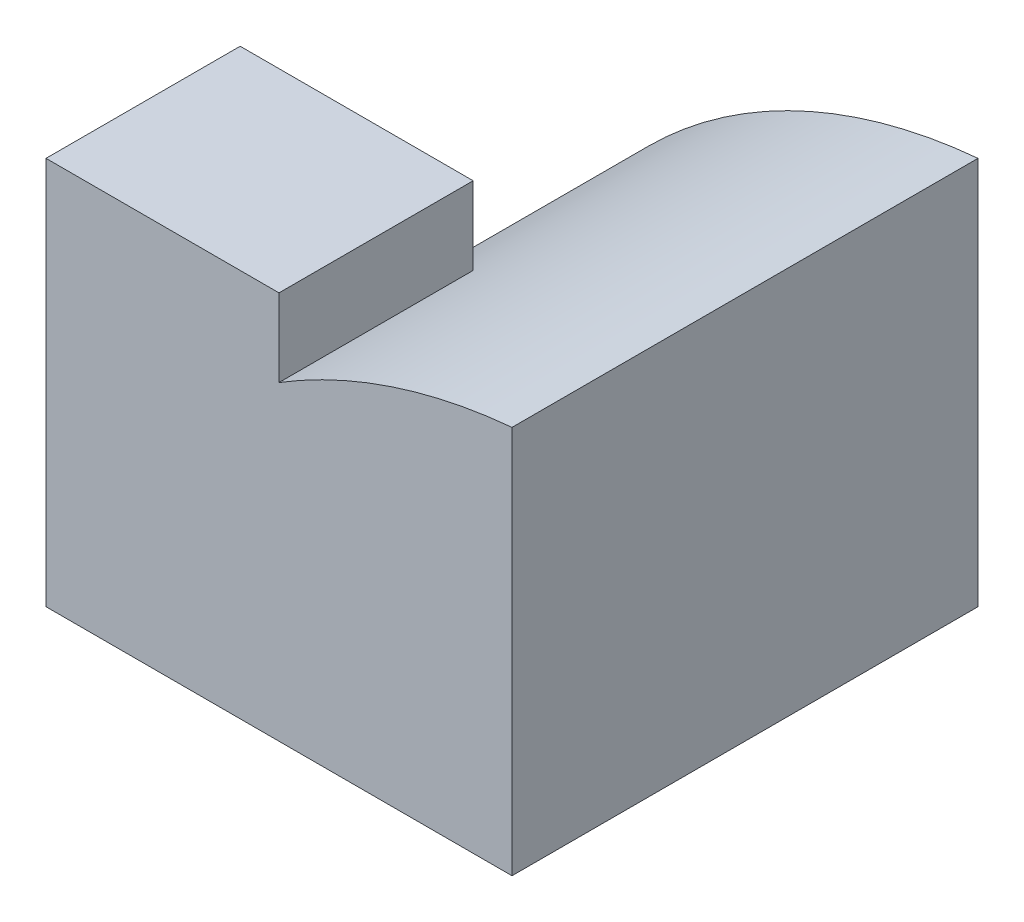
ISO-10303-21;
HEADER;
FILE_DESCRIPTION(('STEP AP214'),'2;1');
FILE_NAME('part.step','',(''),(''),'','','');
FILE_SCHEMA(('AUTOMOTIVE_DESIGN { 1 0 10303 214 1 1 1 1 }'));
ENDSEC;
DATA;
#1=APPLICATION_CONTEXT('core data for automotive mechanical design processes');
#2=APPLICATION_PROTOCOL_DEFINITION('international standard','automotive_design',2000,#1);
#3=PRODUCT_CONTEXT('',#1,'mechanical');
#4=PRODUCT('Part','Part','',(#3));
#5=PRODUCT_RELATED_PRODUCT_CATEGORY('part','',(#4));
#6=PRODUCT_DEFINITION_FORMATION('','',#4);
#7=PRODUCT_DEFINITION_CONTEXT('part definition',#1,'design');
#8=PRODUCT_DEFINITION('design','',#6,#7);
#9=PRODUCT_DEFINITION_SHAPE('','',#8);
#10=(LENGTH_UNIT() NAMED_UNIT(*) SI_UNIT(.MILLI.,.METRE.));
#11=(NAMED_UNIT(*) PLANE_ANGLE_UNIT() SI_UNIT($,.RADIAN.));
#12=(NAMED_UNIT(*) SI_UNIT($,.STERADIAN.) SOLID_ANGLE_UNIT());
#13=UNCERTAINTY_MEASURE_WITH_UNIT(LENGTH_MEASURE(1.E-05),#10,'distance_accuracy_value','');
#14=(GEOMETRIC_REPRESENTATION_CONTEXT(3) GLOBAL_UNCERTAINTY_ASSIGNED_CONTEXT((#13)) GLOBAL_UNIT_ASSIGNED_CONTEXT((#10,
#11,#12)) REPRESENTATION_CONTEXT('',''));
#15=CARTESIAN_POINT('',(0.,0.,0.));
#16=DIRECTION('',(0.,0.,1.));
#17=DIRECTION('',(1.,0.,0.));
#18=AXIS2_PLACEMENT_3D('',#15,#16,#17);
#19=CARTESIAN_POINT('',(-3.,5.,-3.));
#20=DIRECTION('',(0.,0.,1.));
#21=DIRECTION('',(1.,0.,0.));
#22=AXIS2_PLACEMENT_3D('',#19,#20,#21);
#23=PLANE('',#22);
#24=DIRECTION('',(-1.,0.,0.));
#25=VECTOR('',#24,1.);
#26=CARTESIAN_POINT('',(-3.,0.,-3.));
#27=LINE('',#26,#25);
#28=CARTESIAN_POINT('',(3.,0.,-3.));
#29=VERTEX_POINT('',#28);
#30=CARTESIAN_POINT('',(-3.,0.,-3.));
#31=VERTEX_POINT('',#30);
#32=EDGE_CURVE('E87',#29,#31,#27,.T.);
#33=ORIENTED_EDGE('',*,*,#32,.T.);
#34=CARTESIAN_POINT('',(3.61111111111111,-1.83333333333333,-3.));
#35=DIRECTION('',(0.,0.,-1.));
#36=DIRECTION('',(-1.,0.,0.));
#37=AXIS2_PLACEMENT_3D('',#34,#35,#36);
#38=CIRCLE('',#37,6.86060501957137);
#39=CARTESIAN_POINT('',(3.,5.,-3.));
#40=VERTEX_POINT('',#39);
#41=EDGE_CURVE('E118',#40,#31,#38,.F.);
#42=ORIENTED_EDGE('',*,*,#41,.F.);
#43=DIRECTION('',(0.,-1.,0.));
#44=VECTOR('',#43,1.);
#45=CARTESIAN_POINT('',(3.,5.,-3.));
#46=LINE('',#45,#44);
#47=EDGE_CURVE('E11',#40,#29,#46,.T.);
#48=ORIENTED_EDGE('',*,*,#47,.T.);
#49=EDGE_LOOP('',(#33,#42,#48));
#50=FACE_BOUND('',#49,.T.);
#51=ADVANCED_FACE('F33',(#50),#23,.F.);
#52=CARTESIAN_POINT('',(-3.,5.,3.));
#53=DIRECTION('',(1.,0.,0.));
#54=DIRECTION('',(0.,0.,-1.));
#55=AXIS2_PLACEMENT_3D('',#52,#53,#54);
#56=PLANE('',#55);
#57=DIRECTION('',(0.,1.,0.));
#58=VECTOR('',#57,1.);
#59=CARTESIAN_POINT('',(-3.,0.,0.5));
#60=LINE('',#59,#58);
#61=CARTESIAN_POINT('',(-3.,0.,0.5));
#62=VERTEX_POINT('',#61);
#63=CARTESIAN_POINT('',(-3.,5.,0.5));
#64=VERTEX_POINT('',#63);
#65=EDGE_CURVE('E82',#62,#64,#60,.T.);
#66=ORIENTED_EDGE('',*,*,#65,.F.);
#67=DIRECTION('',(0.,0.,1.));
#68=VECTOR('',#67,1.);
#69=CARTESIAN_POINT('',(-3.,0.,3.));
#70=LINE('',#69,#68);
#71=CARTESIAN_POINT('',(-3.,0.,3.));
#72=VERTEX_POINT('',#71);
#73=EDGE_CURVE('E76',#62,#72,#70,.T.);
#74=ORIENTED_EDGE('',*,*,#73,.T.);
#75=DIRECTION('',(0.,-1.,0.));
#76=VECTOR('',#75,1.);
#77=CARTESIAN_POINT('',(-3.,5.,3.));
#78=LINE('',#77,#76);
#79=CARTESIAN_POINT('',(-3.,5.,3.));
#80=VERTEX_POINT('',#79);
#81=EDGE_CURVE('E41',#80,#72,#78,.T.);
#82=ORIENTED_EDGE('',*,*,#81,.F.);
#83=DIRECTION('',(0.,0.,1.));
#84=VECTOR('',#83,1.);
#85=CARTESIAN_POINT('',(-3.,5.,3.));
#86=LINE('',#85,#84);
#87=EDGE_CURVE('E57',#64,#80,#86,.T.);
#88=ORIENTED_EDGE('',*,*,#87,.F.);
#89=EDGE_LOOP('',(#66,#74,#82,#88));
#90=FACE_BOUND('',#89,.T.);
#91=ADVANCED_FACE('F78',(#90),#56,.F.);
#92=CARTESIAN_POINT('',(0.,5.,0.));
#93=DIRECTION('',(0.,-1.,0.));
#94=DIRECTION('',(0.,0.,-1.));
#95=AXIS2_PLACEMENT_3D('',#92,#93,#94);
#96=PLANE('',#95);
#97=DIRECTION('',(1.,0.,0.));
#98=VECTOR('',#97,1.);
#99=CARTESIAN_POINT('',(-3.,5.,3.));
#100=LINE('',#99,#98);
#101=CARTESIAN_POINT('',(0.,5.,3.));
#102=VERTEX_POINT('',#101);
#103=EDGE_CURVE('E95',#80,#102,#100,.T.);
#104=ORIENTED_EDGE('',*,*,#103,.T.);
#105=DIRECTION('',(0.,0.,-1.));
#106=VECTOR('',#105,1.);
#107=CARTESIAN_POINT('',(0.,5.,4.));
#108=LINE('',#107,#106);
#109=CARTESIAN_POINT('',(0.,5.,0.5));
#110=VERTEX_POINT('',#109);
#111=EDGE_CURVE('E138',#102,#110,#108,.T.);
#112=ORIENTED_EDGE('',*,*,#111,.T.);
#113=DIRECTION('',(1.,0.,0.));
#114=VECTOR('',#113,1.);
#115=CARTESIAN_POINT('',(0.,5.,0.5));
#116=LINE('',#115,#114);
#117=EDGE_CURVE('E142',#64,#110,#116,.T.);
#118=ORIENTED_EDGE('',*,*,#117,.F.);
#119=ORIENTED_EDGE('',*,*,#87,.T.);
#120=EDGE_LOOP('',(#104,#112,#118,#119));
#121=FACE_BOUND('',#120,.T.);
#122=ADVANCED_FACE('F141',(#121),#96,.F.);
#123=CARTESIAN_POINT('',(3.,5.,3.));
#124=DIRECTION('',(-1.,0.,0.));
#125=DIRECTION('',(0.,0.,1.));
#126=AXIS2_PLACEMENT_3D('',#123,#124,#125);
#127=PLANE('',#126);
#128=DIRECTION('',(0.,0.,-1.));
#129=VECTOR('',#128,1.);
#130=CARTESIAN_POINT('',(3.,0.,3.));
#131=LINE('',#130,#129);
#132=CARTESIAN_POINT('',(3.,0.,3.));
#133=VERTEX_POINT('',#132);
#134=EDGE_CURVE('E100',#133,#29,#131,.T.);
#135=ORIENTED_EDGE('',*,*,#134,.T.);
#136=ORIENTED_EDGE('',*,*,#47,.F.);
#137=DIRECTION('',(0.,0.,-1.));
#138=VECTOR('',#137,1.);
#139=CARTESIAN_POINT('',(3.,5.,3.));
#140=LINE('',#139,#138);
#141=CARTESIAN_POINT('',(3.,5.,3.));
#142=VERTEX_POINT('',#141);
#143=EDGE_CURVE('E101',#142,#40,#140,.T.);
#144=ORIENTED_EDGE('',*,*,#143,.F.);
#145=DIRECTION('',(0.,-1.,0.));
#146=VECTOR('',#145,1.);
#147=CARTESIAN_POINT('',(3.,5.,3.));
#148=LINE('',#147,#146);
#149=EDGE_CURVE('E96',#142,#133,#148,.T.);
#150=ORIENTED_EDGE('',*,*,#149,.T.);
#151=EDGE_LOOP('',(#135,#136,#144,#150));
#152=FACE_BOUND('',#151,.T.);
#153=ADVANCED_FACE('F35',(#152),#127,.F.);
#154=CARTESIAN_POINT('',(-3.,5.,3.));
#155=DIRECTION('',(0.,0.,-1.));
#156=DIRECTION('',(-1.,0.,0.));
#157=AXIS2_PLACEMENT_3D('',#154,#155,#156);
#158=PLANE('',#157);
#159=ORIENTED_EDGE('',*,*,#149,.F.);
#160=CARTESIAN_POINT('',(3.61111111111111,-1.83333333333333,3.));
#161=DIRECTION('',(0.,0.,-1.));
#162=DIRECTION('',(-1.,0.,0.));
#163=AXIS2_PLACEMENT_3D('',#160,#161,#162);
#164=CIRCLE('',#163,6.86060501957137);
#165=CARTESIAN_POINT('',(0.,4.,3.));
#166=VERTEX_POINT('',#165);
#167=EDGE_CURVE('E148',#142,#166,#164,.F.);
#168=ORIENTED_EDGE('',*,*,#167,.T.);
#169=DIRECTION('',(0.,1.,0.));
#170=VECTOR('',#169,1.);
#171=CARTESIAN_POINT('',(0.,5.,3.));
#172=LINE('',#171,#170);
#173=EDGE_CURVE('E143',#166,#102,#172,.T.);
#174=ORIENTED_EDGE('',*,*,#173,.T.);
#175=ORIENTED_EDGE('',*,*,#103,.F.);
#176=ORIENTED_EDGE('',*,*,#81,.T.);
#177=DIRECTION('',(1.,0.,0.));
#178=VECTOR('',#177,1.);
#179=CARTESIAN_POINT('',(-3.,0.,3.));
#180=LINE('',#179,#178);
#181=EDGE_CURVE('E92',#72,#133,#180,.T.);
#182=ORIENTED_EDGE('',*,*,#181,.T.);
#183=EDGE_LOOP('',(#159,#168,#174,#175,#176,#182));
#184=FACE_BOUND('',#183,.T.);
#185=ADVANCED_FACE('F91',(#184),#158,.F.);
#186=CARTESIAN_POINT('',(0.,0.,0.));
#187=DIRECTION('',(0.,-1.,0.));
#188=DIRECTION('',(0.,0.,-1.));
#189=AXIS2_PLACEMENT_3D('',#186,#187,#188);
#190=PLANE('',#189);
#191=ORIENTED_EDGE('',*,*,#134,.F.);
#192=ORIENTED_EDGE('',*,*,#181,.F.);
#193=ORIENTED_EDGE('',*,*,#73,.F.);
#194=EDGE_CURVE('E86',#31,#62,#70,.T.);
#195=ORIENTED_EDGE('',*,*,#194,.F.);
#196=ORIENTED_EDGE('',*,*,#32,.F.);
#197=EDGE_LOOP('',(#191,#192,#193,#195,#196));
#198=FACE_BOUND('',#197,.T.);
#199=ADVANCED_FACE('F98',(#198),#190,.T.);
#200=CARTESIAN_POINT('',(3.61111111111111,-1.83333333333333,0.5));
#201=DIRECTION('',(0.,0.,-1.));
#202=DIRECTION('',(-1.,0.,0.));
#203=AXIS2_PLACEMENT_3D('',#200,#201,#202);
#204=CYLINDRICAL_SURFACE('',#203,6.86060501957137);
#205=ORIENTED_EDGE('',*,*,#41,.T.);
#206=ORIENTED_EDGE('',*,*,#194,.T.);
#207=CARTESIAN_POINT('',(3.61111111111111,-1.83333333333333,0.5));
#208=DIRECTION('',(0.,0.,-1.));
#209=DIRECTION('',(-1.,0.,0.));
#210=AXIS2_PLACEMENT_3D('',#207,#208,#209);
#211=CIRCLE('',#210,6.86060501957137);
#212=CARTESIAN_POINT('',(0.,4.,0.5));
#213=VERTEX_POINT('',#212);
#214=EDGE_CURVE('E124',#213,#62,#211,.F.);
#215=ORIENTED_EDGE('',*,*,#214,.F.);
#216=DIRECTION('',(0.,0.,-1.));
#217=VECTOR('',#216,1.);
#218=CARTESIAN_POINT('',(0.,4.,4.));
#219=LINE('',#218,#217);
#220=EDGE_CURVE('E48',#166,#213,#219,.T.);
#221=ORIENTED_EDGE('',*,*,#220,.F.);
#222=ORIENTED_EDGE('',*,*,#167,.F.);
#223=ORIENTED_EDGE('',*,*,#143,.T.);
#224=EDGE_LOOP('',(#205,#206,#215,#221,#222,#223));
#225=FACE_BOUND('',#224,.T.);
#226=ADVANCED_FACE('F122',(#225),#204,.T.);
#227=CARTESIAN_POINT('',(0.,0.,0.5));
#228=DIRECTION('',(0.,0.,-1.));
#229=DIRECTION('',(-1.,0.,0.));
#230=AXIS2_PLACEMENT_3D('',#227,#228,#229);
#231=PLANE('',#230);
#232=DIRECTION('',(0.,1.,0.));
#233=VECTOR('',#232,1.);
#234=CARTESIAN_POINT('',(0.,0.,0.5));
#235=LINE('',#234,#233);
#236=EDGE_CURVE('E136',#213,#110,#235,.T.);
#237=ORIENTED_EDGE('',*,*,#236,.F.);
#238=ORIENTED_EDGE('',*,*,#214,.T.);
#239=ORIENTED_EDGE('',*,*,#65,.T.);
#240=ORIENTED_EDGE('',*,*,#117,.T.);
#241=EDGE_LOOP('',(#237,#238,#239,#240));
#242=FACE_BOUND('',#241,.T.);
#243=ADVANCED_FACE('F145',(#242),#231,.T.);
#244=CARTESIAN_POINT('',(0.,0.,4.));
#245=DIRECTION('',(-1.,0.,0.));
#246=DIRECTION('',(0.,-1.,0.));
#247=AXIS2_PLACEMENT_3D('',#244,#245,#246);
#248=PLANE('',#247);
#249=ORIENTED_EDGE('',*,*,#220,.T.);
#250=ORIENTED_EDGE('',*,*,#236,.T.);
#251=ORIENTED_EDGE('',*,*,#111,.F.);
#252=ORIENTED_EDGE('',*,*,#173,.F.);
#253=EDGE_LOOP('',(#249,#250,#251,#252));
#254=FACE_BOUND('',#253,.T.);
#255=ADVANCED_FACE('F137',(#254),#248,.F.);
#256=CLOSED_SHELL('',(#51,#91,#122,#153,#185,#199,#226,#243,#255));
#257=MANIFOLD_SOLID_BREP('B2',#256);
#258=ADVANCED_BREP_SHAPE_REPRESENTATION('',(#18,#257),#14);
#259=SHAPE_DEFINITION_REPRESENTATION(#9,#258);
ENDSEC;
END-ISO-10303-21;
